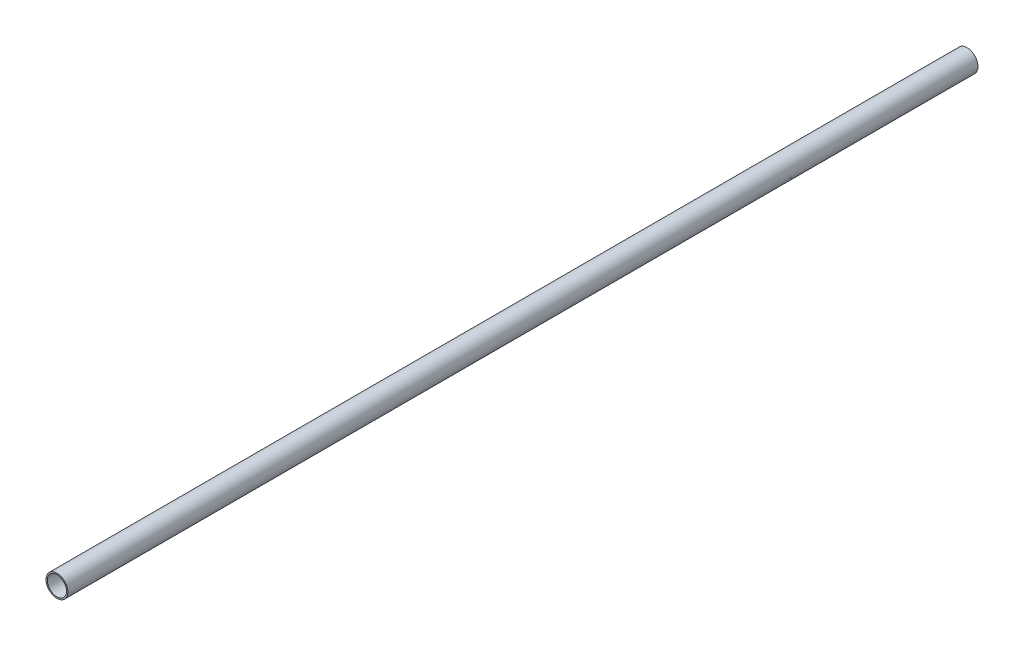
ISO-10303-21;
HEADER;
FILE_DESCRIPTION(('STEP AP214'),'2;1');
FILE_NAME('part.step','',(''),(''),'','','');
FILE_SCHEMA(('AUTOMOTIVE_DESIGN { 1 0 10303 214 1 1 1 1 }'));
ENDSEC;
DATA;
#1=APPLICATION_CONTEXT('core data for automotive mechanical design processes');
#2=APPLICATION_PROTOCOL_DEFINITION('international standard','automotive_design',2000,#1);
#3=PRODUCT_CONTEXT('',#1,'mechanical');
#4=PRODUCT('Part','Part','',(#3));
#5=PRODUCT_RELATED_PRODUCT_CATEGORY('part','',(#4));
#6=PRODUCT_DEFINITION_FORMATION('','',#4);
#7=PRODUCT_DEFINITION_CONTEXT('part definition',#1,'design');
#8=PRODUCT_DEFINITION('design','',#6,#7);
#9=PRODUCT_DEFINITION_SHAPE('','',#8);
#10=(LENGTH_UNIT() NAMED_UNIT(*) SI_UNIT(.MILLI.,.METRE.));
#11=(NAMED_UNIT(*) PLANE_ANGLE_UNIT() SI_UNIT($,.RADIAN.));
#12=(NAMED_UNIT(*) SI_UNIT($,.STERADIAN.) SOLID_ANGLE_UNIT());
#13=UNCERTAINTY_MEASURE_WITH_UNIT(LENGTH_MEASURE(1.E-05),#10,'distance_accuracy_value','');
#14=(GEOMETRIC_REPRESENTATION_CONTEXT(3) GLOBAL_UNCERTAINTY_ASSIGNED_CONTEXT((#13)) GLOBAL_UNIT_ASSIGNED_CONTEXT((#10,
#11,#12)) REPRESENTATION_CONTEXT('',''));
#15=CARTESIAN_POINT('',(0.,0.,0.));
#16=DIRECTION('',(0.,0.,1.));
#17=DIRECTION('',(1.,0.,0.));
#18=AXIS2_PLACEMENT_3D('',#15,#16,#17);
#19=CARTESIAN_POINT('',(0.,719.,-3240.));
#20=DIRECTION('',(0.,0.,1.));
#21=DIRECTION('',(1.,0.,0.));
#22=AXIS2_PLACEMENT_3D('',#19,#20,#21);
#23=CYLINDRICAL_SURFACE('',#22,12.5);
#24=CARTESIAN_POINT('',(0.,719.,-2180.));
#25=DIRECTION('',(0.,0.,1.));
#26=DIRECTION('',(1.,0.,0.));
#27=AXIS2_PLACEMENT_3D('',#24,#25,#26);
#28=CIRCLE('',#27,12.5);
#29=CARTESIAN_POINT('',(12.5,719.,-2180.));
#30=VERTEX_POINT('',#29);
#31=EDGE_CURVE('E48',#30,#30,#28,.T.);
#32=ORIENTED_EDGE('',*,*,#31,.F.);
#33=EDGE_LOOP('',(#32));
#34=FACE_BOUND('',#33,.T.);
#35=CARTESIAN_POINT('',(0.,719.,-3220.));
#36=DIRECTION('',(0.,0.,-1.));
#37=DIRECTION('',(-1.,0.,0.));
#38=AXIS2_PLACEMENT_3D('',#35,#36,#37);
#39=CIRCLE('',#38,12.5);
#40=CARTESIAN_POINT('',(-12.5,719.,-3220.));
#41=VERTEX_POINT('',#40);
#42=EDGE_CURVE('E50',#41,#41,#39,.T.);
#43=ORIENTED_EDGE('',*,*,#42,.F.);
#44=EDGE_LOOP('',(#43));
#45=FACE_BOUND('',#44,.T.);
#46=ADVANCED_FACE('F37',(#34,#45),#23,.T.);
#47=CARTESIAN_POINT('',(-15.5,1960.,-3220.));
#48=DIRECTION('',(0.,0.,-1.));
#49=DIRECTION('',(-1.,0.,0.));
#50=AXIS2_PLACEMENT_3D('',#47,#48,#49);
#51=PLANE('',#50);
#52=CARTESIAN_POINT('',(0.,719.,-3220.));
#53=DIRECTION('',(0.,0.,-1.));
#54=DIRECTION('',(-1.,0.,0.));
#55=AXIS2_PLACEMENT_3D('',#52,#53,#54);
#56=CIRCLE('',#55,11.);
#57=CARTESIAN_POINT('',(-11.,719.,-3220.));
#58=VERTEX_POINT('',#57);
#59=EDGE_CURVE('E41',#58,#58,#56,.T.);
#60=ORIENTED_EDGE('',*,*,#59,.F.);
#61=EDGE_LOOP('',(#60));
#62=FACE_BOUND('',#61,.T.);
#63=ORIENTED_EDGE('',*,*,#42,.T.);
#64=EDGE_LOOP('',(#63));
#65=FACE_BOUND('',#64,.T.);
#66=ADVANCED_FACE('F60',(#62,#65),#51,.T.);
#67=CARTESIAN_POINT('',(-15.5,0.,-2180.));
#68=DIRECTION('',(0.,0.,1.));
#69=DIRECTION('',(1.,0.,0.));
#70=AXIS2_PLACEMENT_3D('',#67,#68,#69);
#71=PLANE('',#70);
#72=CARTESIAN_POINT('',(0.,719.,-2180.));
#73=DIRECTION('',(0.,0.,1.));
#74=DIRECTION('',(1.,0.,0.));
#75=AXIS2_PLACEMENT_3D('',#72,#73,#74);
#76=CIRCLE('',#75,11.);
#77=CARTESIAN_POINT('',(11.,719.,-2180.));
#78=VERTEX_POINT('',#77);
#79=EDGE_CURVE('E10',#78,#78,#76,.T.);
#80=ORIENTED_EDGE('',*,*,#79,.F.);
#81=EDGE_LOOP('',(#80));
#82=FACE_BOUND('',#81,.T.);
#83=ORIENTED_EDGE('',*,*,#31,.T.);
#84=EDGE_LOOP('',(#83));
#85=FACE_BOUND('',#84,.T.);
#86=ADVANCED_FACE('F56',(#82,#85),#71,.T.);
#87=CARTESIAN_POINT('',(0.,719.,-3240.));
#88=DIRECTION('',(0.,0.,1.));
#89=DIRECTION('',(1.,0.,0.));
#90=AXIS2_PLACEMENT_3D('',#87,#88,#89);
#91=CYLINDRICAL_SURFACE('',#90,11.);
#92=ORIENTED_EDGE('',*,*,#59,.T.);
#93=EDGE_LOOP('',(#92));
#94=FACE_BOUND('',#93,.T.);
#95=ORIENTED_EDGE('',*,*,#79,.T.);
#96=EDGE_LOOP('',(#95));
#97=FACE_BOUND('',#96,.T.);
#98=ADVANCED_FACE('F39',(#94,#97),#91,.F.);
#99=CLOSED_SHELL('',(#46,#66,#86,#98));
#100=MANIFOLD_SOLID_BREP('B2',#99);
#101=ADVANCED_BREP_SHAPE_REPRESENTATION('',(#18,#100),#14);
#102=SHAPE_DEFINITION_REPRESENTATION(#9,#101);
ENDSEC;
END-ISO-10303-21;
